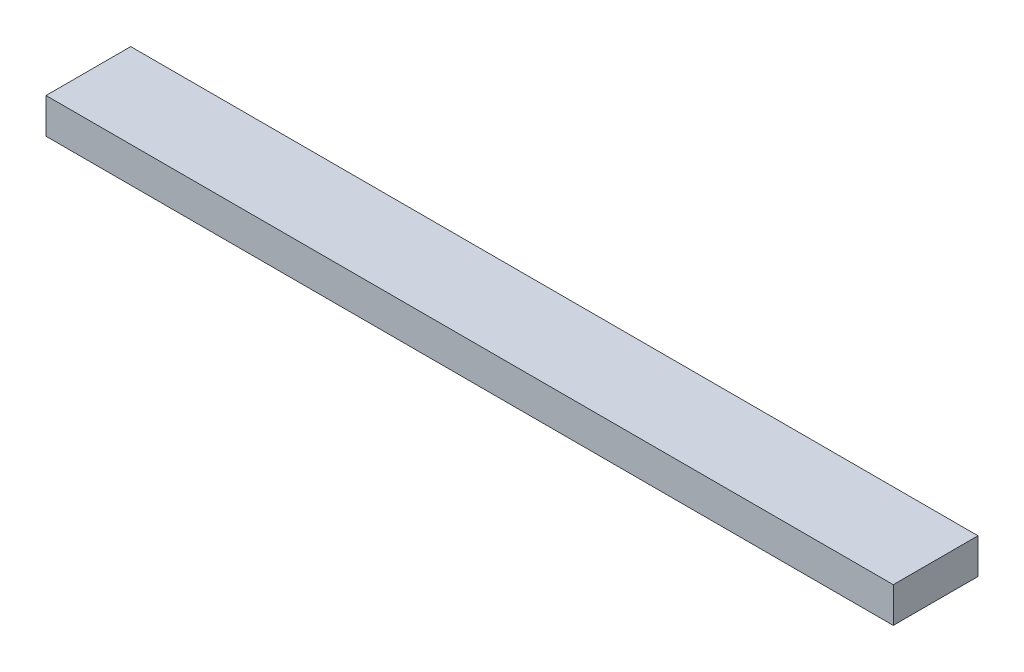
ISO-10303-21;
HEADER;
FILE_DESCRIPTION(('STEP AP214'),'2;1');
FILE_NAME('part.step','',(''),(''),'','','');
FILE_SCHEMA(('AUTOMOTIVE_DESIGN { 1 0 10303 214 1 1 1 1 }'));
ENDSEC;
DATA;
#1=APPLICATION_CONTEXT('core data for automotive mechanical design processes');
#2=APPLICATION_PROTOCOL_DEFINITION('international standard','automotive_design',2000,#1);
#3=PRODUCT_CONTEXT('',#1,'mechanical');
#4=PRODUCT('Part','Part','',(#3));
#5=PRODUCT_RELATED_PRODUCT_CATEGORY('part','',(#4));
#6=PRODUCT_DEFINITION_FORMATION('','',#4);
#7=PRODUCT_DEFINITION_CONTEXT('part definition',#1,'design');
#8=PRODUCT_DEFINITION('design','',#6,#7);
#9=PRODUCT_DEFINITION_SHAPE('','',#8);
#10=(LENGTH_UNIT() NAMED_UNIT(*) SI_UNIT(.MILLI.,.METRE.));
#11=(NAMED_UNIT(*) PLANE_ANGLE_UNIT() SI_UNIT($,.RADIAN.));
#12=(NAMED_UNIT(*) SI_UNIT($,.STERADIAN.) SOLID_ANGLE_UNIT());
#13=UNCERTAINTY_MEASURE_WITH_UNIT(LENGTH_MEASURE(1.E-05),#10,'distance_accuracy_value','');
#14=(GEOMETRIC_REPRESENTATION_CONTEXT(3) GLOBAL_UNCERTAINTY_ASSIGNED_CONTEXT((#13)) GLOBAL_UNIT_ASSIGNED_CONTEXT((#10,
#11,#12)) REPRESENTATION_CONTEXT('',''));
#15=CARTESIAN_POINT('',(0.,0.,0.));
#16=DIRECTION('',(0.,0.,1.));
#17=DIRECTION('',(1.,0.,0.));
#18=AXIS2_PLACEMENT_3D('',#15,#16,#17);
#19=CARTESIAN_POINT('',(38.1,3.175,3.81));
#20=DIRECTION('',(-1.,0.,0.));
#21=DIRECTION('',(0.,0.,1.));
#22=AXIS2_PLACEMENT_3D('',#19,#20,#21);
#23=PLANE('',#22);
#24=DIRECTION('',(0.,0.,-1.));
#25=VECTOR('',#24,1.);
#26=CARTESIAN_POINT('',(38.1,0.,3.81));
#27=LINE('',#26,#25);
#28=CARTESIAN_POINT('',(38.1,0.,3.81));
#29=VERTEX_POINT('',#28);
#30=CARTESIAN_POINT('',(38.1,0.,-3.81));
#31=VERTEX_POINT('',#30);
#32=EDGE_CURVE('E96',#29,#31,#27,.T.);
#33=ORIENTED_EDGE('',*,*,#32,.T.);
#34=DIRECTION('',(0.,-1.,0.));
#35=VECTOR('',#34,1.);
#36=CARTESIAN_POINT('',(38.1,3.175,-3.81));
#37=LINE('',#36,#35);
#38=CARTESIAN_POINT('',(38.1,3.175,-3.81));
#39=VERTEX_POINT('',#38);
#40=EDGE_CURVE('E11',#39,#31,#37,.T.);
#41=ORIENTED_EDGE('',*,*,#40,.F.);
#42=DIRECTION('',(0.,0.,-1.));
#43=VECTOR('',#42,1.);
#44=CARTESIAN_POINT('',(38.1,3.175,3.81));
#45=LINE('',#44,#43);
#46=CARTESIAN_POINT('',(38.1,3.175,3.81));
#47=VERTEX_POINT('',#46);
#48=EDGE_CURVE('E84',#47,#39,#45,.T.);
#49=ORIENTED_EDGE('',*,*,#48,.F.);
#50=DIRECTION('',(0.,-1.,0.));
#51=VECTOR('',#50,1.);
#52=CARTESIAN_POINT('',(38.1,3.175,3.81));
#53=LINE('',#52,#51);
#54=EDGE_CURVE('E92',#47,#29,#53,.T.);
#55=ORIENTED_EDGE('',*,*,#54,.T.);
#56=EDGE_LOOP('',(#33,#41,#49,#55));
#57=FACE_BOUND('',#56,.T.);
#58=ADVANCED_FACE('F33',(#57),#23,.F.);
#59=CARTESIAN_POINT('',(-38.1,3.175,-3.81));
#60=DIRECTION('',(0.,0.,1.));
#61=DIRECTION('',(1.,0.,0.));
#62=AXIS2_PLACEMENT_3D('',#59,#60,#61);
#63=PLANE('',#62);
#64=DIRECTION('',(-1.,0.,0.));
#65=VECTOR('',#64,1.);
#66=CARTESIAN_POINT('',(-38.1,0.,-3.81));
#67=LINE('',#66,#65);
#68=CARTESIAN_POINT('',(-38.1,0.,-3.81));
#69=VERTEX_POINT('',#68);
#70=EDGE_CURVE('E88',#31,#69,#67,.T.);
#71=ORIENTED_EDGE('',*,*,#70,.T.);
#72=DIRECTION('',(0.,-1.,0.));
#73=VECTOR('',#72,1.);
#74=CARTESIAN_POINT('',(-38.1,3.175,-3.81));
#75=LINE('',#74,#73);
#76=CARTESIAN_POINT('',(-38.1,3.175,-3.81));
#77=VERTEX_POINT('',#76);
#78=EDGE_CURVE('E41',#77,#69,#75,.T.);
#79=ORIENTED_EDGE('',*,*,#78,.F.);
#80=DIRECTION('',(-1.,0.,0.));
#81=VECTOR('',#80,1.);
#82=CARTESIAN_POINT('',(-38.1,3.175,-3.81));
#83=LINE('',#82,#81);
#84=EDGE_CURVE('E79',#39,#77,#83,.T.);
#85=ORIENTED_EDGE('',*,*,#84,.F.);
#86=ORIENTED_EDGE('',*,*,#40,.T.);
#87=EDGE_LOOP('',(#71,#79,#85,#86));
#88=FACE_BOUND('',#87,.T.);
#89=ADVANCED_FACE('F87',(#88),#63,.F.);
#90=CARTESIAN_POINT('',(-38.1,3.175,3.81));
#91=DIRECTION('',(1.,0.,0.));
#92=DIRECTION('',(0.,0.,-1.));
#93=AXIS2_PLACEMENT_3D('',#90,#91,#92);
#94=PLANE('',#93);
#95=DIRECTION('',(0.,0.,1.));
#96=VECTOR('',#95,1.);
#97=CARTESIAN_POINT('',(-38.1,0.,3.81));
#98=LINE('',#97,#96);
#99=CARTESIAN_POINT('',(-38.1,0.,3.81));
#100=VERTEX_POINT('',#99);
#101=EDGE_CURVE('E66',#69,#100,#98,.T.);
#102=ORIENTED_EDGE('',*,*,#101,.T.);
#103=DIRECTION('',(0.,-1.,0.));
#104=VECTOR('',#103,1.);
#105=CARTESIAN_POINT('',(-38.1,3.175,3.81));
#106=LINE('',#105,#104);
#107=CARTESIAN_POINT('',(-38.1,3.175,3.81));
#108=VERTEX_POINT('',#107);
#109=EDGE_CURVE('E89',#108,#100,#106,.T.);
#110=ORIENTED_EDGE('',*,*,#109,.F.);
#111=DIRECTION('',(0.,0.,1.));
#112=VECTOR('',#111,1.);
#113=CARTESIAN_POINT('',(-38.1,3.175,3.81));
#114=LINE('',#113,#112);
#115=EDGE_CURVE('E82',#77,#108,#114,.T.);
#116=ORIENTED_EDGE('',*,*,#115,.F.);
#117=ORIENTED_EDGE('',*,*,#78,.T.);
#118=EDGE_LOOP('',(#102,#110,#116,#117));
#119=FACE_BOUND('',#118,.T.);
#120=ADVANCED_FACE('F90',(#119),#94,.F.);
#121=CARTESIAN_POINT('',(-38.1,3.175,3.81));
#122=DIRECTION('',(0.,0.,-1.));
#123=DIRECTION('',(-1.,0.,0.));
#124=AXIS2_PLACEMENT_3D('',#121,#122,#123);
#125=PLANE('',#124);
#126=DIRECTION('',(1.,0.,0.));
#127=VECTOR('',#126,1.);
#128=CARTESIAN_POINT('',(-38.1,0.,3.81));
#129=LINE('',#128,#127);
#130=EDGE_CURVE('E72',#100,#29,#129,.T.);
#131=ORIENTED_EDGE('',*,*,#130,.T.);
#132=ORIENTED_EDGE('',*,*,#54,.F.);
#133=DIRECTION('',(1.,0.,0.));
#134=VECTOR('',#133,1.);
#135=CARTESIAN_POINT('',(-38.1,3.175,3.81));
#136=LINE('',#135,#134);
#137=EDGE_CURVE('E49',#108,#47,#136,.T.);
#138=ORIENTED_EDGE('',*,*,#137,.F.);
#139=ORIENTED_EDGE('',*,*,#109,.T.);
#140=EDGE_LOOP('',(#131,#132,#138,#139));
#141=FACE_BOUND('',#140,.T.);
#142=ADVANCED_FACE('F103',(#141),#125,.F.);
#143=CARTESIAN_POINT('',(0.,3.175,0.));
#144=DIRECTION('',(0.,-1.,0.));
#145=DIRECTION('',(0.,0.,-1.));
#146=AXIS2_PLACEMENT_3D('',#143,#144,#145);
#147=PLANE('',#146);
#148=ORIENTED_EDGE('',*,*,#48,.T.);
#149=ORIENTED_EDGE('',*,*,#84,.T.);
#150=ORIENTED_EDGE('',*,*,#115,.T.);
#151=ORIENTED_EDGE('',*,*,#137,.T.);
#152=EDGE_LOOP('',(#148,#149,#150,#151));
#153=FACE_BOUND('',#152,.T.);
#154=ADVANCED_FACE('F80',(#153),#147,.F.);
#155=CARTESIAN_POINT('',(0.,0.,0.));
#156=DIRECTION('',(0.,-1.,0.));
#157=DIRECTION('',(0.,0.,-1.));
#158=AXIS2_PLACEMENT_3D('',#155,#156,#157);
#159=PLANE('',#158);
#160=ORIENTED_EDGE('',*,*,#32,.F.);
#161=ORIENTED_EDGE('',*,*,#130,.F.);
#162=ORIENTED_EDGE('',*,*,#101,.F.);
#163=ORIENTED_EDGE('',*,*,#70,.F.);
#164=EDGE_LOOP('',(#160,#161,#162,#163));
#165=FACE_BOUND('',#164,.T.);
#166=ADVANCED_FACE('F106',(#165),#159,.T.);
#167=CLOSED_SHELL('',(#58,#89,#120,#142,#154,#166));
#168=MANIFOLD_SOLID_BREP('B2',#167);
#169=ADVANCED_BREP_SHAPE_REPRESENTATION('',(#18,#168),#14);
#170=SHAPE_DEFINITION_REPRESENTATION(#9,#169);
ENDSEC;
END-ISO-10303-21;
